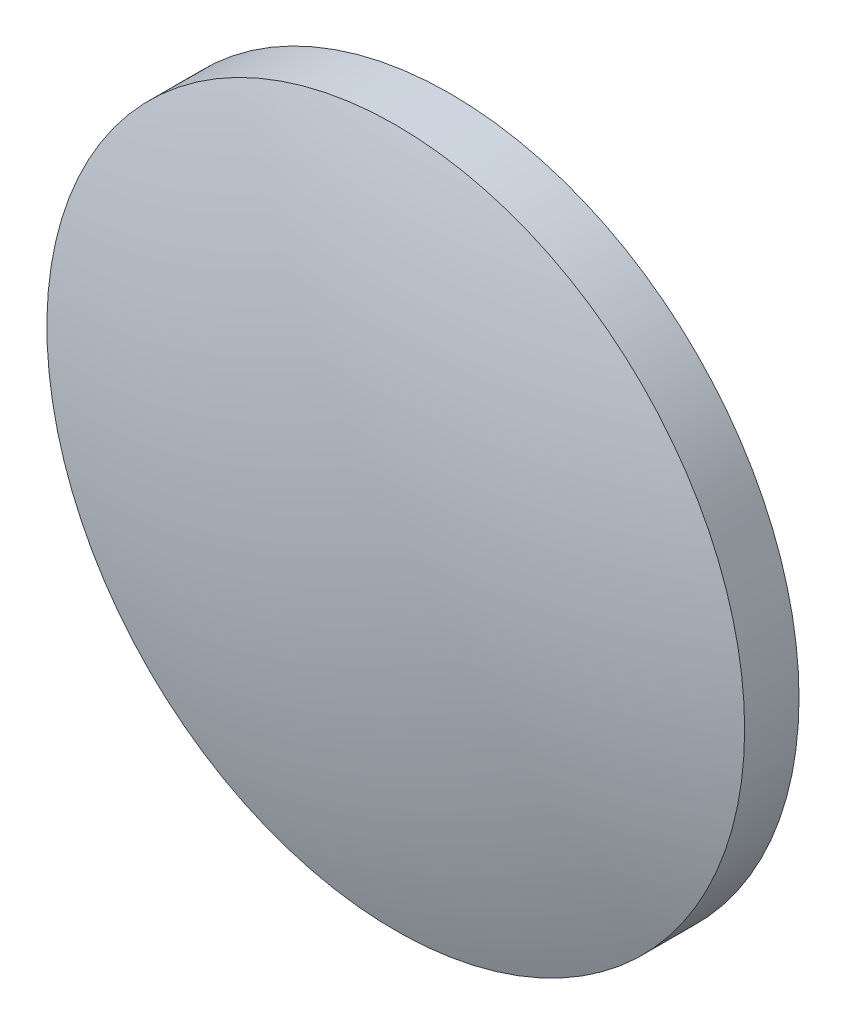
ISO-10303-21;
HEADER;
FILE_DESCRIPTION(('STEP AP214'),'2;1');
FILE_NAME('part.step','',(''),(''),'','','');
FILE_SCHEMA(('AUTOMOTIVE_DESIGN { 1 0 10303 214 1 1 1 1 }'));
ENDSEC;
DATA;
#1=APPLICATION_CONTEXT('core data for automotive mechanical design processes');
#2=APPLICATION_PROTOCOL_DEFINITION('international standard','automotive_design',2000,#1);
#3=PRODUCT_CONTEXT('',#1,'mechanical');
#4=PRODUCT('Part','Part','',(#3));
#5=PRODUCT_RELATED_PRODUCT_CATEGORY('part','',(#4));
#6=PRODUCT_DEFINITION_FORMATION('','',#4);
#7=PRODUCT_DEFINITION_CONTEXT('part definition',#1,'design');
#8=PRODUCT_DEFINITION('design','',#6,#7);
#9=PRODUCT_DEFINITION_SHAPE('','',#8);
#10=(LENGTH_UNIT() NAMED_UNIT(*) SI_UNIT(.MILLI.,.METRE.));
#11=(NAMED_UNIT(*) PLANE_ANGLE_UNIT() SI_UNIT($,.RADIAN.));
#12=(NAMED_UNIT(*) SI_UNIT($,.STERADIAN.) SOLID_ANGLE_UNIT());
#13=UNCERTAINTY_MEASURE_WITH_UNIT(LENGTH_MEASURE(1.E-05),#10,'distance_accuracy_value','');
#14=(GEOMETRIC_REPRESENTATION_CONTEXT(3) GLOBAL_UNCERTAINTY_ASSIGNED_CONTEXT((#13)) GLOBAL_UNIT_ASSIGNED_CONTEXT((#10,
#11,#12)) REPRESENTATION_CONTEXT('',''));
#15=CARTESIAN_POINT('',(0.,0.,0.));
#16=DIRECTION('',(0.,0.,1.));
#17=DIRECTION('',(1.,0.,0.));
#18=AXIS2_PLACEMENT_3D('',#15,#16,#17);
#19=CARTESIAN_POINT('',(0.,0.,-38.5914612574404));
#20=DIRECTION('',(0.,0.,1.));
#21=DIRECTION('',(0.,1.,0.));
#22=AXIS2_PLACEMENT_3D('',#19,#20,#21);
#23=SPHERICAL_SURFACE('',#22,40.6);
#24=CARTESIAN_POINT('',(0.,0.,-0.0289146610342132));
#25=DIRECTION('',(0.,0.,1.));
#26=DIRECTION('',(1.,0.,0.));
#27=AXIS2_PLACEMENT_3D('',#24,#25,#26);
#28=CIRCLE('',#27,12.7);
#29=CARTESIAN_POINT('',(12.7,0.,-0.0289146610342132));
#30=VERTEX_POINT('',#29);
#31=EDGE_CURVE('E8',#30,#30,#28,.T.);
#32=ORIENTED_EDGE('',*,*,#31,.T.);
#33=EDGE_LOOP('',(#32));
#34=FACE_BOUND('',#33,.T.);
#35=ADVANCED_FACE('F12',(#34),#23,.T.);
#36=CARTESIAN_POINT('',(0.,0.,9.28364249740063));
#37=DIRECTION('',(0.,0.,1.));
#38=DIRECTION('',(1.,0.,0.));
#39=AXIS2_PLACEMENT_3D('',#36,#37,#38);
#40=CYLINDRICAL_SURFACE('',#39,12.7);
#41=ORIENTED_EDGE('',*,*,#31,.F.);
#42=EDGE_LOOP('',(#41));
#43=FACE_BOUND('',#42,.T.);
#44=CARTESIAN_POINT('',(0.,0.,-2.00853874255958));
#45=DIRECTION('',(0.,0.,1.));
#46=DIRECTION('',(1.,0.,0.));
#47=AXIS2_PLACEMENT_3D('',#44,#45,#46);
#48=CIRCLE('',#47,12.7);
#49=CARTESIAN_POINT('',(12.7,0.,-2.00853874255958));
#50=VERTEX_POINT('',#49);
#51=EDGE_CURVE('E18',#50,#50,#48,.T.);
#52=ORIENTED_EDGE('',*,*,#51,.T.);
#53=EDGE_LOOP('',(#52));
#54=FACE_BOUND('',#53,.T.);
#55=ADVANCED_FACE('F24',(#43,#54),#40,.T.);
#56=CARTESIAN_POINT('',(0.,0.,-108.15146125744));
#57=DIRECTION('',(0.,0.,1.));
#58=DIRECTION('',(0.,1.,0.));
#59=AXIS2_PLACEMENT_3D('',#56,#57,#58);
#60=SPHERICAL_SURFACE('',#59,106.9);
#61=ORIENTED_EDGE('',*,*,#51,.F.);
#62=EDGE_LOOP('',(#61));
#63=FACE_BOUND('',#62,.T.);
#64=ADVANCED_FACE('F26',(#63),#60,.F.);
#65=CLOSED_SHELL('',(#35,#55,#64));
#66=MANIFOLD_SOLID_BREP('B1',#65);
#67=ADVANCED_BREP_SHAPE_REPRESENTATION('',(#18,#66),#14);
#68=SHAPE_DEFINITION_REPRESENTATION(#9,#67);
ENDSEC;
END-ISO-10303-21;
